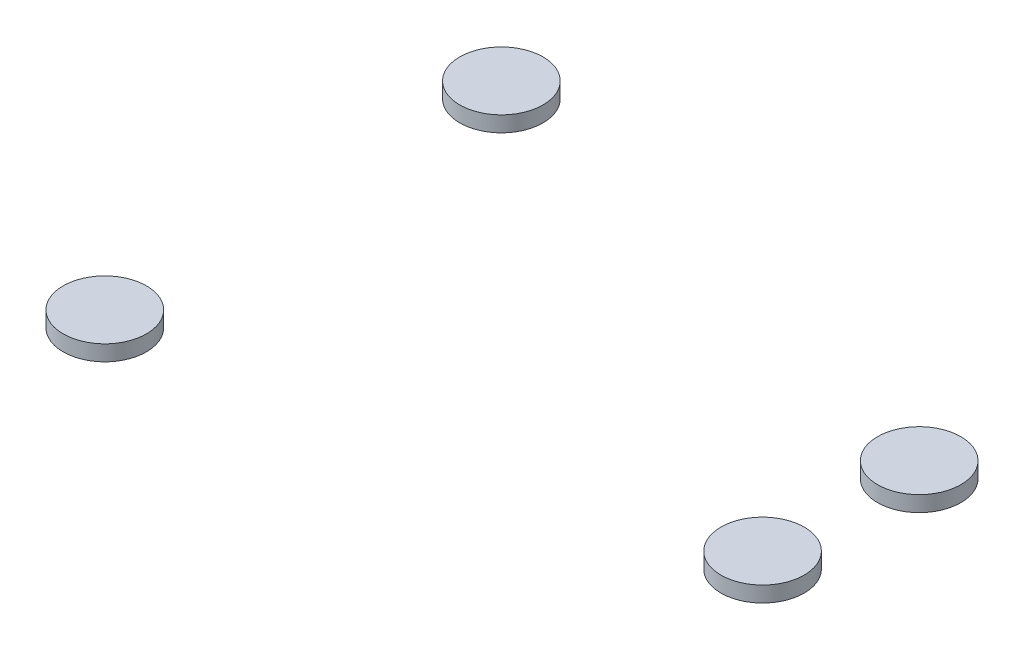
ISO-10303-21;
HEADER;
FILE_DESCRIPTION(('STEP AP214'),'2;1');
FILE_NAME('part.step','',(''),(''),'','','');
FILE_SCHEMA(('AUTOMOTIVE_DESIGN { 1 0 10303 214 1 1 1 1 }'));
ENDSEC;
DATA;
#1=APPLICATION_CONTEXT('core data for automotive mechanical design processes');
#2=APPLICATION_PROTOCOL_DEFINITION('international standard','automotive_design',2000,#1);
#3=PRODUCT_CONTEXT('',#1,'mechanical');
#4=PRODUCT('Part','Part','',(#3));
#5=PRODUCT_RELATED_PRODUCT_CATEGORY('part','',(#4));
#6=PRODUCT_DEFINITION_FORMATION('','',#4);
#7=PRODUCT_DEFINITION_CONTEXT('part definition',#1,'design');
#8=PRODUCT_DEFINITION('design','',#6,#7);
#9=PRODUCT_DEFINITION_SHAPE('','',#8);
#10=(LENGTH_UNIT() NAMED_UNIT(*) SI_UNIT(.MILLI.,.METRE.));
#11=(NAMED_UNIT(*) PLANE_ANGLE_UNIT() SI_UNIT($,.RADIAN.));
#12=(NAMED_UNIT(*) SI_UNIT($,.STERADIAN.) SOLID_ANGLE_UNIT());
#13=UNCERTAINTY_MEASURE_WITH_UNIT(LENGTH_MEASURE(1.E-05),#10,'distance_accuracy_value','');
#14=(GEOMETRIC_REPRESENTATION_CONTEXT(3) GLOBAL_UNCERTAINTY_ASSIGNED_CONTEXT((#13)) GLOBAL_UNIT_ASSIGNED_CONTEXT((#10,
#11,#12)) REPRESENTATION_CONTEXT('',''));
#15=CARTESIAN_POINT('',(0.,0.,0.));
#16=DIRECTION('',(0.,0.,1.));
#17=DIRECTION('',(1.,0.,0.));
#18=AXIS2_PLACEMENT_3D('',#15,#16,#17);
#19=CARTESIAN_POINT('',(-11.,-1.5,-19.0525588832577));
#20=DIRECTION('',(0.,1.,0.));
#21=DIRECTION('',(0.,0.,1.));
#22=AXIS2_PLACEMENT_3D('',#19,#20,#21);
#23=CYLINDRICAL_SURFACE('',#22,4.);
#24=CARTESIAN_POINT('',(-11.,-1.5,-19.0525588832577));
#25=DIRECTION('',(0.,1.,0.));
#26=DIRECTION('',(0.,0.,-1.));
#27=AXIS2_PLACEMENT_3D('',#24,#25,#26);
#28=CIRCLE('',#27,4.);
#29=CARTESIAN_POINT('',(-11.,-1.5,-23.0525588832577));
#30=VERTEX_POINT('',#29);
#31=EDGE_CURVE('E11',#30,#30,#28,.T.);
#32=ORIENTED_EDGE('',*,*,#31,.T.);
#33=EDGE_LOOP('',(#32));
#34=FACE_BOUND('',#33,.T.);
#35=CARTESIAN_POINT('',(-11.,0.,-19.0525588832577));
#36=DIRECTION('',(0.,1.,0.));
#37=DIRECTION('',(0.,0.,-1.));
#38=AXIS2_PLACEMENT_3D('',#35,#36,#37);
#39=CIRCLE('',#38,4.);
#40=CARTESIAN_POINT('',(-11.,0.,-23.0525588832577));
#41=VERTEX_POINT('',#40);
#42=EDGE_CURVE('E43',#41,#41,#39,.T.);
#43=ORIENTED_EDGE('',*,*,#42,.F.);
#44=EDGE_LOOP('',(#43));
#45=FACE_BOUND('',#44,.T.);
#46=ADVANCED_FACE('F40',(#34,#45),#23,.T.);
#47=CARTESIAN_POINT('',(-11.,-1.5,-19.0525588832577));
#48=DIRECTION('',(0.,-1.,0.));
#49=DIRECTION('',(0.,0.,-1.));
#50=AXIS2_PLACEMENT_3D('',#47,#48,#49);
#51=PLANE('',#50);
#52=ORIENTED_EDGE('',*,*,#31,.F.);
#53=EDGE_LOOP('',(#52));
#54=FACE_BOUND('',#53,.T.);
#55=ADVANCED_FACE('F55',(#54),#51,.T.);
#56=CARTESIAN_POINT('',(-11.,0.,-19.0525588832577));
#57=DIRECTION('',(0.,-1.,0.));
#58=DIRECTION('',(0.,0.,-1.));
#59=AXIS2_PLACEMENT_3D('',#56,#57,#58);
#60=PLANE('',#59);
#61=ORIENTED_EDGE('',*,*,#42,.T.);
#62=EDGE_LOOP('',(#61));
#63=FACE_BOUND('',#62,.T.);
#64=ADVANCED_FACE('F52',(#63),#60,.F.);
#65=CLOSED_SHELL('',(#46,#55,#64));
#66=MANIFOLD_SOLID_BREP('B2',#65);
#67=CARTESIAN_POINT('',(40.67323765729,-1.5,-7.52444315316458));
#68=DIRECTION('',(0.,1.,0.));
#69=DIRECTION('',(0.,0.,1.));
#70=AXIS2_PLACEMENT_3D('',#67,#68,#69);
#71=CYLINDRICAL_SURFACE('',#70,4.00000000000001);
#72=CARTESIAN_POINT('',(40.67323765729,-1.5,-7.52444315316458));
#73=DIRECTION('',(0.,1.,0.));
#74=DIRECTION('',(0.,0.,-1.));
#75=AXIS2_PLACEMENT_3D('',#72,#73,#74);
#76=CIRCLE('',#75,4.00000000000001);
#77=CARTESIAN_POINT('',(40.67323765729,-1.5,-11.5244431531646));
#78=VERTEX_POINT('',#77);
#79=EDGE_CURVE('E39',#78,#78,#76,.T.);
#80=ORIENTED_EDGE('',*,*,#79,.T.);
#81=EDGE_LOOP('',(#80));
#82=FACE_BOUND('',#81,.T.);
#83=CARTESIAN_POINT('',(40.67323765729,0.,-7.52444315316458));
#84=DIRECTION('',(0.,1.,0.));
#85=DIRECTION('',(0.,0.,-1.));
#86=AXIS2_PLACEMENT_3D('',#83,#84,#85);
#87=CIRCLE('',#86,4.00000000000001);
#88=CARTESIAN_POINT('',(40.67323765729,0.,-11.5244431531646));
#89=VERTEX_POINT('',#88);
#90=EDGE_CURVE('E92',#89,#89,#87,.T.);
#91=ORIENTED_EDGE('',*,*,#90,.F.);
#92=EDGE_LOOP('',(#91));
#93=FACE_BOUND('',#92,.T.);
#94=ADVANCED_FACE('F89',(#82,#93),#71,.T.);
#95=CARTESIAN_POINT('',(40.67323765729,-1.5,-7.52444315316458));
#96=DIRECTION('',(0.,-1.,0.));
#97=DIRECTION('',(0.,0.,-1.));
#98=AXIS2_PLACEMENT_3D('',#95,#96,#97);
#99=PLANE('',#98);
#100=ORIENTED_EDGE('',*,*,#79,.F.);
#101=EDGE_LOOP('',(#100));
#102=FACE_BOUND('',#101,.T.);
#103=ADVANCED_FACE('F104',(#102),#99,.T.);
#104=CARTESIAN_POINT('',(40.67323765729,0.,-7.52444315316458));
#105=DIRECTION('',(0.,-1.,0.));
#106=DIRECTION('',(0.,0.,-1.));
#107=AXIS2_PLACEMENT_3D('',#104,#105,#106);
#108=PLANE('',#107);
#109=ORIENTED_EDGE('',*,*,#90,.T.);
#110=EDGE_LOOP('',(#109));
#111=FACE_BOUND('',#110,.T.);
#112=ADVANCED_FACE('F101',(#111),#108,.F.);
#113=CLOSED_SHELL('',(#94,#103,#112));
#114=MANIFOLD_SOLID_BREP('B6',#113);
#115=CARTESIAN_POINT('',(40.67323765729,-1.5,7.52444315316458));
#116=DIRECTION('',(0.,1.,0.));
#117=DIRECTION('',(0.,0.,1.));
#118=AXIS2_PLACEMENT_3D('',#115,#116,#117);
#119=CYLINDRICAL_SURFACE('',#118,4.00000000000001);
#120=CARTESIAN_POINT('',(40.67323765729,-1.5,7.52444315316458));
#121=DIRECTION('',(0.,1.,0.));
#122=DIRECTION('',(0.,0.,1.));
#123=AXIS2_PLACEMENT_3D('',#120,#121,#122);
#124=CIRCLE('',#123,4.00000000000001);
#125=CARTESIAN_POINT('',(40.67323765729,-1.5,11.5244431531646));
#126=VERTEX_POINT('',#125);
#127=EDGE_CURVE('E88',#126,#126,#124,.T.);
#128=ORIENTED_EDGE('',*,*,#127,.T.);
#129=EDGE_LOOP('',(#128));
#130=FACE_BOUND('',#129,.T.);
#131=CARTESIAN_POINT('',(40.67323765729,0.,7.52444315316458));
#132=DIRECTION('',(0.,1.,0.));
#133=DIRECTION('',(0.,0.,1.));
#134=AXIS2_PLACEMENT_3D('',#131,#132,#133);
#135=CIRCLE('',#134,4.00000000000001);
#136=CARTESIAN_POINT('',(40.67323765729,0.,11.5244431531646));
#137=VERTEX_POINT('',#136);
#138=EDGE_CURVE('E140',#137,#137,#135,.T.);
#139=ORIENTED_EDGE('',*,*,#138,.F.);
#140=EDGE_LOOP('',(#139));
#141=FACE_BOUND('',#140,.T.);
#142=ADVANCED_FACE('F137',(#130,#141),#119,.T.);
#143=CARTESIAN_POINT('',(40.67323765729,-1.5,7.52444315316458));
#144=DIRECTION('',(0.,1.,0.));
#145=DIRECTION('',(0.,0.,1.));
#146=AXIS2_PLACEMENT_3D('',#143,#144,#145);
#147=PLANE('',#146);
#148=ORIENTED_EDGE('',*,*,#127,.F.);
#149=EDGE_LOOP('',(#148));
#150=FACE_BOUND('',#149,.T.);
#151=ADVANCED_FACE('F152',(#150),#147,.F.);
#152=CARTESIAN_POINT('',(40.67323765729,0.,7.52444315316458));
#153=DIRECTION('',(0.,1.,0.));
#154=DIRECTION('',(0.,0.,1.));
#155=AXIS2_PLACEMENT_3D('',#152,#153,#154);
#156=PLANE('',#155);
#157=ORIENTED_EDGE('',*,*,#138,.T.);
#158=EDGE_LOOP('',(#157));
#159=FACE_BOUND('',#158,.T.);
#160=ADVANCED_FACE('F149',(#159),#156,.T.);
#161=CLOSED_SHELL('',(#142,#151,#160));
#162=MANIFOLD_SOLID_BREP('B34',#161);
#163=CARTESIAN_POINT('',(-11.,-1.5,19.0525588832577));
#164=DIRECTION('',(0.,1.,0.));
#165=DIRECTION('',(0.,0.,1.));
#166=AXIS2_PLACEMENT_3D('',#163,#164,#165);
#167=CYLINDRICAL_SURFACE('',#166,4.);
#168=CARTESIAN_POINT('',(-11.,-1.5,19.0525588832577));
#169=DIRECTION('',(0.,1.,0.));
#170=DIRECTION('',(0.,0.,1.));
#171=AXIS2_PLACEMENT_3D('',#168,#169,#170);
#172=CIRCLE('',#171,4.);
#173=CARTESIAN_POINT('',(-11.,-1.5,23.0525588832577));
#174=VERTEX_POINT('',#173);
#175=EDGE_CURVE('E136',#174,#174,#172,.T.);
#176=ORIENTED_EDGE('',*,*,#175,.T.);
#177=EDGE_LOOP('',(#176));
#178=FACE_BOUND('',#177,.T.);
#179=CARTESIAN_POINT('',(-11.,0.,19.0525588832577));
#180=DIRECTION('',(0.,1.,0.));
#181=DIRECTION('',(0.,0.,1.));
#182=AXIS2_PLACEMENT_3D('',#179,#180,#181);
#183=CIRCLE('',#182,4.);
#184=CARTESIAN_POINT('',(-11.,0.,23.0525588832577));
#185=VERTEX_POINT('',#184);
#186=EDGE_CURVE('E181',#185,#185,#183,.T.);
#187=ORIENTED_EDGE('',*,*,#186,.F.);
#188=EDGE_LOOP('',(#187));
#189=FACE_BOUND('',#188,.T.);
#190=ADVANCED_FACE('F178',(#178,#189),#167,.T.);
#191=CARTESIAN_POINT('',(-11.,-1.5,19.0525588832577));
#192=DIRECTION('',(0.,1.,0.));
#193=DIRECTION('',(0.,0.,1.));
#194=AXIS2_PLACEMENT_3D('',#191,#192,#193);
#195=PLANE('',#194);
#196=ORIENTED_EDGE('',*,*,#175,.F.);
#197=EDGE_LOOP('',(#196));
#198=FACE_BOUND('',#197,.T.);
#199=ADVANCED_FACE('F193',(#198),#195,.F.);
#200=CARTESIAN_POINT('',(-11.,0.,19.0525588832577));
#201=DIRECTION('',(0.,1.,0.));
#202=DIRECTION('',(0.,0.,1.));
#203=AXIS2_PLACEMENT_3D('',#200,#201,#202);
#204=PLANE('',#203);
#205=ORIENTED_EDGE('',*,*,#186,.T.);
#206=EDGE_LOOP('',(#205));
#207=FACE_BOUND('',#206,.T.);
#208=ADVANCED_FACE('F190',(#207),#204,.T.);
#209=CLOSED_SHELL('',(#190,#199,#208));
#210=MANIFOLD_SOLID_BREP('B83',#209);
#211=ADVANCED_BREP_SHAPE_REPRESENTATION('',(#18,#66,#114,#162,#210),#14);
#212=SHAPE_DEFINITION_REPRESENTATION(#9,#211);
ENDSEC;
END-ISO-10303-21;
